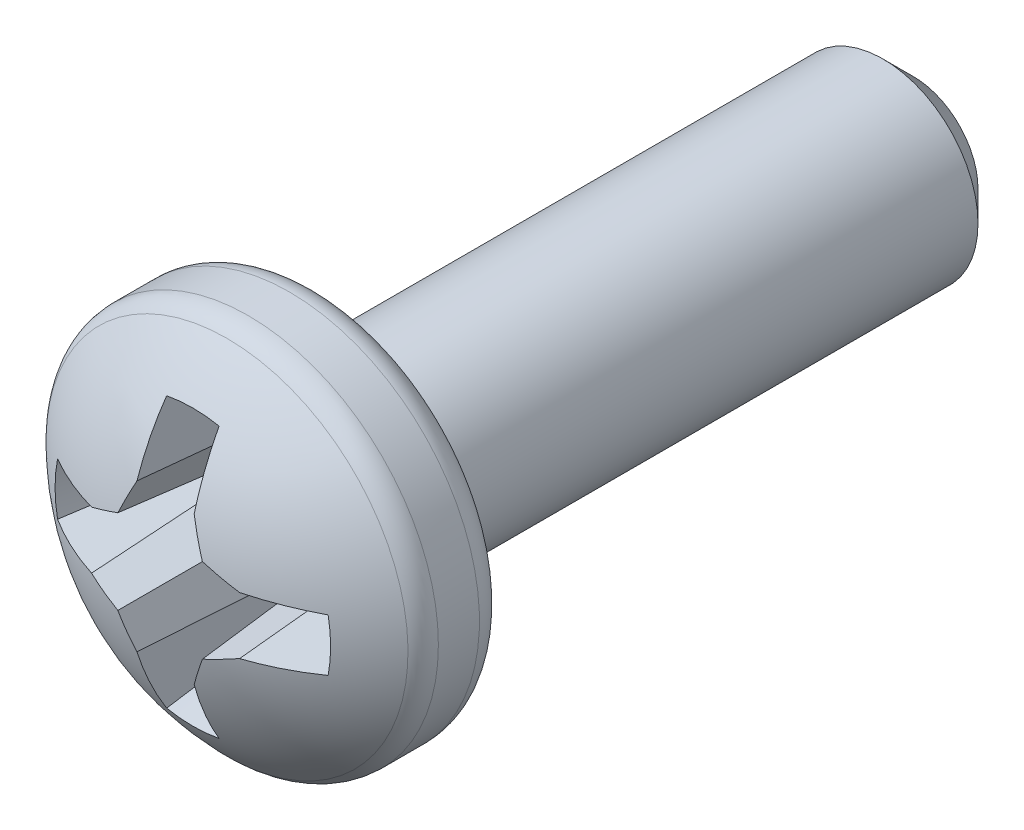
ISO-10303-21;
HEADER;
FILE_DESCRIPTION(('STEP AP214'),'2;1');
FILE_NAME('part.step','',(''),(''),'','','');
FILE_SCHEMA(('AUTOMOTIVE_DESIGN { 1 0 10303 214 1 1 1 1 }'));
ENDSEC;
DATA;
#1=APPLICATION_CONTEXT('core data for automotive mechanical design processes');
#2=APPLICATION_PROTOCOL_DEFINITION('international standard','automotive_design',2000,#1);
#3=PRODUCT_CONTEXT('',#1,'mechanical');
#4=PRODUCT('Part','Part','',(#3));
#5=PRODUCT_RELATED_PRODUCT_CATEGORY('part','',(#4));
#6=PRODUCT_DEFINITION_FORMATION('','',#4);
#7=PRODUCT_DEFINITION_CONTEXT('part definition',#1,'design');
#8=PRODUCT_DEFINITION('design','',#6,#7);
#9=PRODUCT_DEFINITION_SHAPE('','',#8);
#10=(LENGTH_UNIT() NAMED_UNIT(*) SI_UNIT(.MILLI.,.METRE.));
#11=(NAMED_UNIT(*) PLANE_ANGLE_UNIT() SI_UNIT($,.RADIAN.));
#12=(NAMED_UNIT(*) SI_UNIT($,.STERADIAN.) SOLID_ANGLE_UNIT());
#13=UNCERTAINTY_MEASURE_WITH_UNIT(LENGTH_MEASURE(1.E-05),#10,'distance_accuracy_value','');
#14=(GEOMETRIC_REPRESENTATION_CONTEXT(3) GLOBAL_UNCERTAINTY_ASSIGNED_CONTEXT((#13)) GLOBAL_UNIT_ASSIGNED_CONTEXT((#10,
#11,#12)) REPRESENTATION_CONTEXT('',''));
#15=CARTESIAN_POINT('',(0.,0.,0.));
#16=DIRECTION('',(0.,0.,1.));
#17=DIRECTION('',(1.,0.,0.));
#18=AXIS2_PLACEMENT_3D('',#15,#16,#17);
#19=CARTESIAN_POINT('',(0.515078325384203,0.791461441644268,0.413196607862429));
#20=DIRECTION('',(0.,0.,1.));
#21=DIRECTION('',(1.,0.,0.));
#22=AXIS2_PLACEMENT_3D('',#19,#20,#21);
#23=PLANE('',#22);
#24=DIRECTION('',(0.382683432365081,-0.92387953251129,0.));
#25=VECTOR('',#24,1.);
#26=CARTESIAN_POINT('',(0.528392212154071,0.796976234112247,0.413196607862429));
#27=LINE('',#26,#25);
#28=CARTESIAN_POINT('',(0.520821966738698,0.815252423264536,0.413196607862429));
#29=VERTEX_POINT('',#28);
#30=CARTESIAN_POINT('',(0.526107910320162,0.802491026580226,0.413196607862429));
#31=VERTEX_POINT('',#30);
#32=EDGE_CURVE('E292',#29,#31,#27,.T.);
#33=ORIENTED_EDGE('',*,*,#32,.F.);
#34=DIRECTION('',(0.,1.,0.));
#35=VECTOR('',#34,1.);
#36=CARTESIAN_POINT('',(0.520821966738698,0.791461441644268,0.413196607862429));
#37=LINE('',#36,#35);
#38=CARTESIAN_POINT('',(0.520821966738698,0.827667770325845,0.413196607862429));
#39=VERTEX_POINT('',#38);
#40=EDGE_CURVE('E168',#39,#29,#37,.F.);
#41=ORIENTED_EDGE('',*,*,#40,.F.);
#42=CARTESIAN_POINT('',(0.515078325384203,0.791461441644268,0.413196607862429));
#43=DIRECTION('',(0.,0.,1.));
#44=DIRECTION('',(1.,0.,0.));
#45=AXIS2_PLACEMENT_3D('',#42,#43,#44);
#46=CIRCLE('',#45,0.0366590732644382);
#47=CARTESIAN_POINT('',(0.509334684029712,0.827667770325846,0.413196607862429));
#48=VERTEX_POINT('',#47);
#49=EDGE_CURVE('E159',#39,#48,#46,.T.);
#50=ORIENTED_EDGE('',*,*,#49,.T.);
#51=DIRECTION('',(0.,1.,0.));
#52=VECTOR('',#51,1.);
#53=CARTESIAN_POINT('',(0.509334684029713,0.791461441644271,0.413196607862429));
#54=LINE('',#53,#52);
#55=CARTESIAN_POINT('',(0.509334684029712,0.815252423264539,0.413196607862429));
#56=VERTEX_POINT('',#55);
#57=EDGE_CURVE('E166',#56,#48,#54,.T.);
#58=ORIENTED_EDGE('',*,*,#57,.F.);
#59=DIRECTION('',(0.382683432365079,0.923879532511291,0.));
#60=VECTOR('',#59,1.);
#61=CARTESIAN_POINT('',(0.501764438614339,0.79697623411225,0.413196607862429));
#62=LINE('',#61,#60);
#63=CARTESIAN_POINT('',(0.504048740448248,0.802491026580229,0.413196607862429));
#64=VERTEX_POINT('',#63);
#65=EDGE_CURVE('E301',#64,#56,#62,.T.);
#66=ORIENTED_EDGE('',*,*,#65,.F.);
#67=DIRECTION('',(0.923879532511289,0.382683432365086,0.));
#68=VECTOR('',#67,1.);
#69=CARTESIAN_POINT('',(0.509563532916228,0.804775328414139,0.413196607862429));
#70=LINE('',#69,#68);
#71=CARTESIAN_POINT('',(0.491287343763938,0.797205082998765,0.413196607862429));
#72=VERTEX_POINT('',#71);
#73=EDGE_CURVE('E307',#72,#64,#70,.T.);
#74=ORIENTED_EDGE('',*,*,#73,.F.);
#75=DIRECTION('',(1.,0.,0.));
#76=VECTOR('',#75,1.);
#77=CARTESIAN_POINT('',(0.515078325384207,0.797205082998765,0.413196607862429));
#78=LINE('',#77,#76);
#79=CARTESIAN_POINT('',(0.478871996676527,0.797205082997996,0.413196607853642));
#80=VERTEX_POINT('',#79);
#81=EDGE_CURVE('E313',#80,#72,#78,.T.);
#82=ORIENTED_EDGE('',*,*,#81,.F.);
#83=CARTESIAN_POINT('',(0.515078325384206,0.791461441644271,0.413196607862429));
#84=DIRECTION('',(0.,0.,1.));
#85=DIRECTION('',(1.,0.,0.));
#86=AXIS2_PLACEMENT_3D('',#83,#84,#85);
#87=CIRCLE('',#86,0.0366590732924525);
#88=CARTESIAN_POINT('',(0.478871996674264,0.78571780028978,0.413196607862429));
#89=VERTEX_POINT('',#88);
#90=EDGE_CURVE('E410',#80,#89,#87,.T.);
#91=ORIENTED_EDGE('',*,*,#90,.T.);
#92=DIRECTION('',(1.,0.,0.));
#93=VECTOR('',#92,1.);
#94=CARTESIAN_POINT('',(0.515078325384203,0.78571780028978,0.413196607862429));
#95=LINE('',#94,#93);
#96=CARTESIAN_POINT('',(0.491287343763935,0.78571780028978,0.413196607862429));
#97=VERTEX_POINT('',#96);
#98=EDGE_CURVE('E247',#97,#89,#95,.F.);
#99=ORIENTED_EDGE('',*,*,#98,.F.);
#100=DIRECTION('',(-0.923879532511292,0.382683432365076,0.));
#101=VECTOR('',#100,1.);
#102=CARTESIAN_POINT('',(0.509563532916224,0.778147554874406,0.413196607862429));
#103=LINE('',#102,#101);
#104=CARTESIAN_POINT('',(0.504048740448245,0.780431856708316,0.413196607862429));
#105=VERTEX_POINT('',#104);
#106=EDGE_CURVE('E248',#105,#97,#103,.T.);
#107=ORIENTED_EDGE('',*,*,#106,.F.);
#108=DIRECTION('',(-0.38268343236509,0.923879532511287,0.));
#109=VECTOR('',#108,1.);
#110=CARTESIAN_POINT('',(0.501764438614335,0.785946649176296,0.413196607862429));
#111=LINE('',#110,#109);
#112=CARTESIAN_POINT('',(0.50933468402971,0.767670460024005,0.413196607862429));
#113=VERTEX_POINT('',#112);
#114=EDGE_CURVE('E254',#113,#105,#111,.T.);
#115=ORIENTED_EDGE('',*,*,#114,.F.);
#116=DIRECTION('',(0.,1.,0.));
#117=VECTOR('',#116,1.);
#118=CARTESIAN_POINT('',(0.509334684029709,0.791461441644275,0.413196607862429));
#119=LINE('',#118,#117);
#120=CARTESIAN_POINT('',(0.50933468402971,0.755255112980187,0.413196607862429));
#121=VERTEX_POINT('',#120);
#122=EDGE_CURVE('E260',#121,#113,#119,.T.);
#123=ORIENTED_EDGE('',*,*,#122,.F.);
#124=CARTESIAN_POINT('',(0.515078325384204,0.791461441644275,0.413196607862429));
#125=DIRECTION('',(0.,0.,1.));
#126=DIRECTION('',(1.,0.,0.));
#127=AXIS2_PLACEMENT_3D('',#124,#125,#126);
#128=CIRCLE('',#127,0.036659073247165);
#129=CARTESIAN_POINT('',(0.520821966738695,0.755255112980186,0.413196607862429));
#130=VERTEX_POINT('',#129);
#131=EDGE_CURVE('E336',#121,#130,#128,.T.);
#132=ORIENTED_EDGE('',*,*,#131,.T.);
#133=DIRECTION('',(0.,1.,0.));
#134=VECTOR('',#133,1.);
#135=CARTESIAN_POINT('',(0.520821966738694,0.791461441644272,0.413196607862429));
#136=LINE('',#135,#134);
#137=CARTESIAN_POINT('',(0.520821966738695,0.767670460024002,0.413196607862429));
#138=VERTEX_POINT('',#137);
#139=EDGE_CURVE('E266',#138,#130,#136,.F.);
#140=ORIENTED_EDGE('',*,*,#139,.F.);
#141=DIRECTION('',(-0.382683432365075,-0.923879532511293,0.));
#142=VECTOR('',#141,1.);
#143=CARTESIAN_POINT('',(0.528392212154069,0.785946649176293,0.413196607862429));
#144=LINE('',#143,#142);
#145=CARTESIAN_POINT('',(0.526107910320159,0.780431856708313,0.413196607862429));
#146=VERTEX_POINT('',#145);
#147=EDGE_CURVE('E267',#146,#138,#144,.T.);
#148=ORIENTED_EDGE('',*,*,#147,.F.);
#149=DIRECTION('',(-0.923879532511286,-0.382683432365092,0.));
#150=VECTOR('',#149,1.);
#151=CARTESIAN_POINT('',(0.520593117852179,0.778147554874402,0.413196607862429));
#152=LINE('',#151,#150);
#153=CARTESIAN_POINT('',(0.538869307004469,0.785717800289777,0.413196607862429));
#154=VERTEX_POINT('',#153);
#155=EDGE_CURVE('E273',#154,#146,#152,.T.);
#156=ORIENTED_EDGE('',*,*,#155,.F.);
#157=DIRECTION('',(1.,0.,0.));
#158=VECTOR('',#157,1.);
#159=CARTESIAN_POINT('',(0.5150783253842,0.785717800289777,0.413196607862429));
#160=LINE('',#159,#158);
#161=CARTESIAN_POINT('',(0.551284654065781,0.785717800289777,0.413196607862429));
#162=VERTEX_POINT('',#161);
#163=EDGE_CURVE('E279',#162,#154,#160,.F.);
#164=ORIENTED_EDGE('',*,*,#163,.F.);
#165=CARTESIAN_POINT('',(0.515078325384203,0.791461441644268,0.413196607862429));
#166=DIRECTION('',(0.,0.,1.));
#167=DIRECTION('',(1.,0.,0.));
#168=AXIS2_PLACEMENT_3D('',#165,#166,#167);
#169=CIRCLE('',#168,0.0366590732644382);
#170=CARTESIAN_POINT('',(0.55128465406578,0.797205082998762,0.413196607862429));
#171=VERTEX_POINT('',#170);
#172=EDGE_CURVE('E492',#162,#171,#169,.T.);
#173=ORIENTED_EDGE('',*,*,#172,.T.);
#174=DIRECTION('',(1.,0.,0.));
#175=VECTOR('',#174,1.);
#176=CARTESIAN_POINT('',(0.515078325384203,0.797205082998762,0.413196607862429));
#177=LINE('',#176,#175);
#178=CARTESIAN_POINT('',(0.538869307004472,0.797205082998762,0.413196607862429));
#179=VERTEX_POINT('',#178);
#180=EDGE_CURVE('E285',#179,#171,#177,.T.);
#181=ORIENTED_EDGE('',*,*,#180,.F.);
#182=DIRECTION('',(0.92387953251129,-0.382683432365083,0.));
#183=VECTOR('',#182,1.);
#184=CARTESIAN_POINT('',(0.520593117852183,0.804775328414136,0.413196607862429));
#185=LINE('',#184,#183);
#186=EDGE_CURVE('E286',#31,#179,#185,.T.);
#187=ORIENTED_EDGE('',*,*,#186,.F.);
#188=EDGE_LOOP('',(#33,#41,#50,#58,#66,#74,#82,#91,#99,#107,#115,#123,#132,#140,#148,#156,#164,
#173,#181,#187));
#189=FACE_BOUND('',#188,.T.);
#190=ADVANCED_FACE('F17',(#189),#23,.T.);
#191=CARTESIAN_POINT('',(0.515078325384207,0.801303961329311,0.460047001563216));
#192=DIRECTION('',(0.,-0.996194698091744,0.0871557427476727));
#193=DIRECTION('',(0.,-0.0871557427476727,-0.996194698091744));
#194=AXIS2_PLACEMENT_3D('',#191,#192,#193);
#195=PLANE('',#194);
#196=DIRECTION('',(0.0173337504938421,-0.0871426484044557,-0.996045029063884));
#197=VECTOR('',#196,1.);
#198=CARTESIAN_POINT('',(0.490543943259579,0.8009424097128,0.455914447676356));
#199=LINE('',#198,#197);
#200=CARTESIAN_POINT('',(0.490543943259579,0.8009424097128,0.455914447676356));
#201=VERTEX_POINT('',#200);
#202=EDGE_CURVE('E310',#201,#72,#199,.T.);
#203=ORIENTED_EDGE('',*,*,#202,.F.);
#204=CARTESIAN_POINT('',(0.4702306923124,0.80015108887588,0.446869609122098));
#205=CARTESIAN_POINT('',(0.473419051995565,0.800321424804083,0.448816557690383));
#206=CARTESIAN_POINT('',(0.476706002749408,0.800472536171256,0.450543768520713));
#207=CARTESIAN_POINT('',(0.483477086398446,0.800736309783544,0.453558714705461));
#208=CARTESIAN_POINT('',(0.486961219293642,0.800848972028658,0.45484645005988));
#209=CARTESIAN_POINT('',(0.490543943259515,0.800942409712743,0.455914447676344));
#210=B_SPLINE_CURVE_WITH_KNOTS('',3,(#204,#205,#206,#207,#208,#209),.UNSPECIFIED.,.F.,.F.,(4,2,
4),(0.,0.0111485978671285,0.0222971957342569),.UNSPECIFIED.);
#211=CARTESIAN_POINT('',(0.470230692322977,0.800151088874494,0.446869609106245));
#212=VERTEX_POINT('',#211);
#213=EDGE_CURVE('E409',#212,#201,#210,.T.);
#214=ORIENTED_EDGE('',*,*,#213,.F.);
#215=CARTESIAN_POINT('',(0.470230692333555,0.800151088873107,0.446869609090391));
#216=CARTESIAN_POINT('',(0.471667160111317,0.79966000435443,0.441256487356838));
#217=CARTESIAN_POINT('',(0.473105502686871,0.799168961608414,0.435643843086986));
#218=CARTESIAN_POINT('',(0.475985937468524,0.798186959649785,0.424419509338453));
#219=CARTESIAN_POINT('',(0.477428029674714,0.797696000437175,0.418807819859794));
#220=CARTESIAN_POINT('',(0.478871996678788,0.797205082997228,0.413196607844861));
#221=B_SPLINE_CURVE_WITH_KNOTS('',3,(#215,#216,#217,#218,#219,#220),.UNSPECIFIED.,.F.,.F.,(4,2,
4),(0.,0.0174443558891328,0.0348887122017161),.UNSPECIFIED.);
#222=EDGE_CURVE('E318',#212,#80,#221,.T.);
#223=ORIENTED_EDGE('',*,*,#222,.T.);
#224=ORIENTED_EDGE('',*,*,#81,.T.);
#225=EDGE_LOOP('',(#203,#214,#223,#224));
#226=FACE_BOUND('',#225,.T.);
#227=ADVANCED_FACE('F427',(#226),#195,.T.);
#228=CARTESIAN_POINT('',(0.507994960087848,0.808562198209984,0.460047001563216));
#229=DIRECTION('',(0.381227206369649,-0.920363891963225,0.0871557427476661));
#230=DIRECTION('',(0.923879532511289,0.382683432365086,0.));
#231=AXIS2_PLACEMENT_3D('',#228,#229,#230);
#232=PLANE('',#231);
#233=DIRECTION('',(0.0666626913468223,-0.0666626913468416,-0.995546167269401));
#234=VECTOR('',#233,1.);
#235=CARTESIAN_POINT('',(0.501066961696687,0.805472805331791,0.457726739301586));
#236=LINE('',#235,#234);
#237=CARTESIAN_POINT('',(0.501066961696687,0.805472805331791,0.457726739301586));
#238=VERTEX_POINT('',#237);
#239=EDGE_CURVE('E304',#238,#64,#236,.T.);
#240=ORIENTED_EDGE('',*,*,#239,.F.);
#241=CARTESIAN_POINT('',(0.490543943259579,0.8009424097128,0.455914447676356));
#242=CARTESIAN_POINT('',(0.492274312814514,0.801700049456703,0.456346321822599));
#243=CARTESIAN_POINT('',(0.494016415795073,0.802456402296903,0.456713283197823));
#244=CARTESIAN_POINT('',(0.497524088607443,0.8039665341699,0.457317380406233));
#245=CARTESIAN_POINT('',(0.499289658439253,0.804720313202696,0.457554516239419));
#246=CARTESIAN_POINT('',(0.501066961696687,0.805472805331791,0.457726739301586));
#247=B_SPLINE_CURVE_WITH_KNOTS('',3,(#241,#242,#243,#244,#245,#246),.UNSPECIFIED.,.F.,.F.,(4,2,
4),(0.,0.00580300590917721,0.0116060118183544),.UNSPECIFIED.);
#248=EDGE_CURVE('E439',#201,#238,#247,.T.);
#249=ORIENTED_EDGE('',*,*,#248,.F.);
#250=ORIENTED_EDGE('',*,*,#202,.T.);
#251=ORIENTED_EDGE('',*,*,#73,.T.);
#252=EDGE_LOOP('',(#240,#249,#250,#251));
#253=FACE_BOUND('',#252,.T.);
#254=ADVANCED_FACE('F431',(#253),#232,.T.);
#255=CARTESIAN_POINT('',(0.497977568818494,0.79854480694063,0.460047001563216));
#256=DIRECTION('',(0.920363891963229,-0.381227206369643,0.0871557427476506));
#257=DIRECTION('',(0.382683432365079,0.923879532511291,0.));
#258=AXIS2_PLACEMENT_3D('',#255,#256,#257);
#259=PLANE('',#258);
#260=DIRECTION('',(0.0871426484044276,-0.0173337504938855,-0.996045029063886));
#261=VECTOR('',#260,1.);
#262=CARTESIAN_POINT('',(0.505597357315678,0.8159958237689,0.455914447676355));
#263=LINE('',#262,#261);
#264=CARTESIAN_POINT('',(0.505597357315678,0.8159958237689,0.455914447676355));
#265=VERTEX_POINT('',#264);
#266=EDGE_CURVE('E176',#265,#56,#263,.T.);
#267=ORIENTED_EDGE('',*,*,#266,.F.);
#268=CARTESIAN_POINT('',(0.501066961696687,0.805472805331791,0.457726739301586));
#269=CARTESIAN_POINT('',(0.501819453825782,0.807250108589226,0.457554516239419));
#270=CARTESIAN_POINT('',(0.502573232858578,0.809015678421036,0.457317380406232));
#271=CARTESIAN_POINT('',(0.504083364731575,0.812523351233405,0.456713283197822));
#272=CARTESIAN_POINT('',(0.504839717571775,0.814265454213965,0.456346321822598));
#273=CARTESIAN_POINT('',(0.505597357315678,0.8159958237689,0.455914447676355));
#274=B_SPLINE_CURVE_WITH_KNOTS('',3,(#268,#269,#270,#271,#272,#273),.UNSPECIFIED.,.F.,.F.,(4,2,
4),(0.,0.00580300590917794,0.0116060118183557),.UNSPECIFIED.);
#275=EDGE_CURVE('E445',#238,#265,#274,.T.);
#276=ORIENTED_EDGE('',*,*,#275,.F.);
#277=ORIENTED_EDGE('',*,*,#239,.T.);
#278=ORIENTED_EDGE('',*,*,#65,.T.);
#279=EDGE_LOOP('',(#267,#276,#277,#278));
#280=FACE_BOUND('',#279,.T.);
#281=ADVANCED_FACE('F436',(#280),#259,.T.);
#282=CARTESIAN_POINT('',(0.505235805699168,0.791461441644271,0.460047001563216));
#283=DIRECTION('',(0.996194698091747,0.,0.0871557427476441));
#284=DIRECTION('',(0.0871557427476441,0.,-0.996194698091747));
#285=AXIS2_PLACEMENT_3D('',#282,#283,#284);
#286=PLANE('',#285);
#287=CARTESIAN_POINT('',(0.509334684031052,0.827667770321906,0.413196607847123));
#288=CARTESIAN_POINT('',(0.508843766591138,0.829111737330646,0.418807819861677));
#289=CARTESIAN_POINT('',(0.508352807378561,0.830553829541518,0.424419509339952));
#290=CARTESIAN_POINT('',(0.50737080542,0.833434264332566,0.435643843087716));
#291=CARTESIAN_POINT('',(0.506879762674018,0.834872606912833,0.44125648735718));
#292=CARTESIAN_POINT('',(0.506388678155376,0.836309074695323,0.446869609090344));
#293=B_SPLINE_CURVE_WITH_KNOTS('',3,(#287,#288,#289,#290,#291,#292),.UNSPECIFIED.,.F.,.F.,(4,2,
4),(0.,0.01744435631495,0.0348887122064498),.UNSPECIFIED.);
#294=CARTESIAN_POINT('',(0.506388678157148,0.836309074690137,0.446869609070085));
#295=VERTEX_POINT('',#294);
#296=EDGE_CURVE('E170',#48,#295,#293,.T.);
#297=ORIENTED_EDGE('',*,*,#296,.T.);
#298=CARTESIAN_POINT('',(0.505597357315678,0.8159958237689,0.455914447676355));
#299=CARTESIAN_POINT('',(0.505690794999793,0.819578547734809,0.454846450059887));
#300=CARTESIAN_POINT('',(0.505803457244927,0.823062680630038,0.453558714705458));
#301=CARTESIAN_POINT('',(0.506067230857234,0.829833764279139,0.450543768520679));
#302=CARTESIAN_POINT('',(0.506218342224407,0.833120715033011,0.448816557690328));
#303=CARTESIAN_POINT('',(0.5063886781526,0.836309074716203,0.446869609122017));
#304=B_SPLINE_CURVE_WITH_KNOTS('',3,(#298,#299,#300,#301,#302,#303),.UNSPECIFIED.,.F.,.F.,(4,2,
4),(0.,0.0111485978672344,0.022297195734469),.UNSPECIFIED.);
#305=EDGE_CURVE('E450',#265,#295,#304,.T.);
#306=ORIENTED_EDGE('',*,*,#305,.F.);
#307=ORIENTED_EDGE('',*,*,#266,.T.);
#308=ORIENTED_EDGE('',*,*,#57,.T.);
#309=EDGE_LOOP('',(#297,#306,#307,#308));
#310=FACE_BOUND('',#309,.T.);
#311=ADVANCED_FACE('F173',(#310),#286,.T.);
#312=CARTESIAN_POINT('',(0.515078325384203,0.791461441644268,0.446869608879297));
#313=DIRECTION('',(0.,0.,1.));
#314=DIRECTION('',(1.,0.,0.));
#315=AXIS2_PLACEMENT_3D('',#312,#313,#314);
#316=CONICAL_SURFACE('',#315,0.0456817266976294,0.261799387909679);
#317=ORIENTED_EDGE('',*,*,#296,.F.);
#318=ORIENTED_EDGE('',*,*,#49,.F.);
#319=CARTESIAN_POINT('',(0.523767972615257,0.836309074701822,0.446869609115738));
#320=CARTESIAN_POINT('',(0.523276888096404,0.834872606918724,0.44125648738018));
#321=CARTESIAN_POINT('',(0.522785845350213,0.833434264337848,0.43564384310832));
#322=CARTESIAN_POINT('',(0.521803843391233,0.830553829545579,0.424419509355768));
#323=CARTESIAN_POINT('',(0.521312884178447,0.829111737334096,0.418807819875098));
#324=CARTESIAN_POINT('',(0.520821966738323,0.827667770324744,0.413196607858151));
#325=B_SPLINE_CURVE_WITH_KNOTS('',3,(#319,#320,#321,#322,#323,#324),.UNSPECIFIED.,.F.,.F.,(4,2,
4),(0.,0.0174443558989396,0.0348887122213296),.UNSPECIFIED.);
#326=CARTESIAN_POINT('',(0.523767972615744,0.836309074705034,0.44686960912131));
#327=VERTEX_POINT('',#326);
#328=EDGE_CURVE('E182',#327,#39,#325,.T.);
#329=ORIENTED_EDGE('',*,*,#328,.F.);
#330=CARTESIAN_POINT('',(0.515078325384203,0.791461441644268,0.446869609049827));
#331=DIRECTION('',(0.,0.,1.));
#332=DIRECTION('',(1.,0.,0.));
#333=AXIS2_PLACEMENT_3D('',#330,#331,#332);
#334=CIRCLE('',#333,0.0456817267433228);
#335=EDGE_CURVE('E180',#295,#327,#334,.F.);
#336=ORIENTED_EDGE('',*,*,#335,.F.);
#337=EDGE_LOOP('',(#317,#318,#329,#336));
#338=FACE_BOUND('',#337,.T.);
#339=ADVANCED_FACE('F178',(#338),#316,.F.);
#340=CARTESIAN_POINT('',(0.524920845069243,0.791461441644268,0.460047001563216));
#341=DIRECTION('',(-0.996194698091746,0.,0.0871557427476584));
#342=DIRECTION('',(0.0871557427476584,0.,0.996194698091746));
#343=AXIS2_PLACEMENT_3D('',#340,#341,#342);
#344=PLANE('',#343);
#345=DIRECTION('',(-0.0871426484044405,-0.0173337504938649,-0.996045029063885));
#346=VECTOR('',#345,1.);
#347=CARTESIAN_POINT('',(0.524559293452732,0.815995823768896,0.455914447676356));
#348=LINE('',#347,#346);
#349=CARTESIAN_POINT('',(0.524559293452732,0.815995823768896,0.455914447676356));
#350=VERTEX_POINT('',#349);
#351=EDGE_CURVE('E295',#350,#29,#348,.T.);
#352=ORIENTED_EDGE('',*,*,#351,.F.);
#353=CARTESIAN_POINT('',(0.523767972616232,0.836309074708246,0.446869609126883));
#354=CARTESIAN_POINT('',(0.523938308544324,0.833120715026192,0.448816557694025));
#355=CARTESIAN_POINT('',(0.524089419911412,0.829833764273554,0.450543768523385));
#356=CARTESIAN_POINT('',(0.524353193523581,0.823062680627109,0.453558714706541));
#357=CARTESIAN_POINT('',(0.524465855768661,0.819578547733302,0.454846450060337));
#358=CARTESIAN_POINT('',(0.524559293452738,0.81599582376891,0.45591444767635));
#359=B_SPLINE_CURVE_WITH_KNOTS('',3,(#353,#354,#355,#356,#357,#358),.UNSPECIFIED.,.F.,.F.,(4,2,
4),(0.,0.0111485978625707,0.0222971957251414),.UNSPECIFIED.);
#360=EDGE_CURVE('E210',#327,#350,#359,.T.);
#361=ORIENTED_EDGE('',*,*,#360,.F.);
#362=ORIENTED_EDGE('',*,*,#328,.T.);
#363=ORIENTED_EDGE('',*,*,#40,.T.);
#364=EDGE_LOOP('',(#352,#361,#362,#363));
#365=FACE_BOUND('',#364,.T.);
#366=ADVANCED_FACE('F199',(#365),#344,.T.);
#367=CARTESIAN_POINT('',(0.532179081949916,0.798544806940627,0.460047001563216));
#368=DIRECTION('',(-0.920363891963228,-0.381227206369645,0.0871557427476584));
#369=DIRECTION('',(0.382683432365081,-0.92387953251129,0.));
#370=AXIS2_PLACEMENT_3D('',#367,#368,#369);
#371=PLANE('',#370);
#372=DIRECTION('',(-0.066662691346815,-0.0666626913468393,-0.995546167269402));
#373=VECTOR('',#372,1.);
#374=CARTESIAN_POINT('',(0.529089689071723,0.805472805331788,0.457726739301586));
#375=LINE('',#374,#373);
#376=CARTESIAN_POINT('',(0.529089689071723,0.805472805331788,0.457726739301586));
#377=VERTEX_POINT('',#376);
#378=EDGE_CURVE('E289',#377,#31,#375,.T.);
#379=ORIENTED_EDGE('',*,*,#378,.F.);
#380=CARTESIAN_POINT('',(0.524559293452732,0.815995823768896,0.455914447676356));
#381=CARTESIAN_POINT('',(0.525316933196635,0.814265454213961,0.456346321822598));
#382=CARTESIAN_POINT('',(0.526073286036835,0.812523351233401,0.456713283197823));
#383=CARTESIAN_POINT('',(0.527583417909832,0.809015678421032,0.457317380406233));
#384=CARTESIAN_POINT('',(0.528337196942628,0.807250108589223,0.457554516239419));
#385=CARTESIAN_POINT('',(0.529089689071723,0.805472805331788,0.457726739301586));
#386=B_SPLINE_CURVE_WITH_KNOTS('',3,(#380,#381,#382,#383,#384,#385),.UNSPECIFIED.,.F.,.F.,(4,2,
4),(0.,0.00580300590917684,0.0116060118183539),.UNSPECIFIED.);
#387=EDGE_CURVE('E218',#350,#377,#386,.T.);
#388=ORIENTED_EDGE('',*,*,#387,.F.);
#389=ORIENTED_EDGE('',*,*,#351,.T.);
#390=ORIENTED_EDGE('',*,*,#32,.T.);
#391=EDGE_LOOP('',(#379,#388,#389,#390));
#392=FACE_BOUND('',#391,.T.);
#393=ADVANCED_FACE('F204',(#392),#371,.T.);
#394=CARTESIAN_POINT('',(0.522161690680563,0.808562198209981,0.460047001563216));
#395=DIRECTION('',(-0.381227206369647,-0.920363891963227,0.0871557427476583));
#396=DIRECTION('',(0.92387953251129,-0.382683432365083,0.));
#397=AXIS2_PLACEMENT_3D('',#394,#395,#396);
#398=PLANE('',#397);
#399=DIRECTION('',(-0.0173337504938598,-0.0871426484044405,-0.996045029063885));
#400=VECTOR('',#399,1.);
#401=CARTESIAN_POINT('',(0.539612707508832,0.800942409712797,0.455914447676356));
#402=LINE('',#401,#400);
#403=CARTESIAN_POINT('',(0.539612707508832,0.800942409712797,0.455914447676356));
#404=VERTEX_POINT('',#403);
#405=EDGE_CURVE('E282',#404,#179,#402,.T.);
#406=ORIENTED_EDGE('',*,*,#405,.F.);
#407=CARTESIAN_POINT('',(0.529089689071723,0.805472805331788,0.457726739301586));
#408=CARTESIAN_POINT('',(0.530866992329158,0.804720313202694,0.457554516239419));
#409=CARTESIAN_POINT('',(0.532632562160968,0.803966534169897,0.457317380406232));
#410=CARTESIAN_POINT('',(0.536140234973337,0.8024564022969,0.456713283197822));
#411=CARTESIAN_POINT('',(0.537882337953897,0.8017000494567,0.456346321822598));
#412=CARTESIAN_POINT('',(0.539612707508832,0.800942409712797,0.455914447676355));
#413=B_SPLINE_CURVE_WITH_KNOTS('',3,(#407,#408,#409,#410,#411,#412),.UNSPECIFIED.,.F.,.F.,(4,2,
4),(0.,0.00580300590917777,0.0116060118183553),.UNSPECIFIED.);
#414=EDGE_CURVE('E462',#377,#404,#413,.T.);
#415=ORIENTED_EDGE('',*,*,#414,.F.);
#416=ORIENTED_EDGE('',*,*,#378,.T.);
#417=ORIENTED_EDGE('',*,*,#186,.T.);
#418=EDGE_LOOP('',(#406,#415,#416,#417));
#419=FACE_BOUND('',#418,.T.);
#420=ADVANCED_FACE('F474',(#419),#398,.T.);
#421=CARTESIAN_POINT('',(0.515078325384203,0.801303961329307,0.460047001563216));
#422=DIRECTION('',(0.,-0.996194698091746,0.0871557427476584));
#423=DIRECTION('',(0.,-0.0871557427476584,-0.996194698091746));
#424=AXIS2_PLACEMENT_3D('',#421,#422,#423);
#425=PLANE('',#424);
#426=CARTESIAN_POINT('',(0.551284654061709,0.797205082997378,0.413196607846613));
#427=CARTESIAN_POINT('',(0.552728621070471,0.797696000437299,0.418807819861252));
#428=CARTESIAN_POINT('',(0.554170713281365,0.798186959649884,0.424419509339612));
#429=CARTESIAN_POINT('',(0.557051148072456,0.799168961608459,0.435643843087546));
#430=CARTESIAN_POINT('',(0.558489490652745,0.799660004354449,0.441256487357095));
#431=CARTESIAN_POINT('',(0.559925958435257,0.800151088873099,0.446869609090344));
#432=B_SPLINE_CURVE_WITH_KNOTS('',3,(#426,#427,#428,#429,#430,#431),.UNSPECIFIED.,.F.,.F.,(4,2,
4),(0.,0.0174443563152142,0.0348887122069779),.UNSPECIFIED.);
#433=CARTESIAN_POINT('',(0.559925958430071,0.800151088871326,0.446869609070085));
#434=VERTEX_POINT('',#433);
#435=EDGE_CURVE('E351',#171,#434,#432,.T.);
#436=ORIENTED_EDGE('',*,*,#435,.T.);
#437=CARTESIAN_POINT('',(0.539612707508832,0.800942409712797,0.455914447676355));
#438=CARTESIAN_POINT('',(0.543195431474753,0.800848972028701,0.454846450059881));
#439=CARTESIAN_POINT('',(0.546679564369995,0.800736309783567,0.453558714705447));
#440=CARTESIAN_POINT('',(0.553450648019119,0.80047253617122,0.450543768520659));
#441=CARTESIAN_POINT('',(0.556737598773001,0.800321424804007,0.448816557690305));
#442=CARTESIAN_POINT('',(0.559925958456204,0.800151088875756,0.44686960912199));
#443=B_SPLINE_CURVE_WITH_KNOTS('',3,(#437,#438,#439,#440,#441,#442),.UNSPECIFIED.,.F.,.F.,(4,2,
4),(0.,0.0111485978672741,0.0222971957345481),.UNSPECIFIED.);
#444=EDGE_CURVE('E463',#404,#434,#443,.T.);
#445=ORIENTED_EDGE('',*,*,#444,.F.);
#446=ORIENTED_EDGE('',*,*,#405,.T.);
#447=ORIENTED_EDGE('',*,*,#180,.T.);
#448=EDGE_LOOP('',(#436,#445,#446,#447));
#449=FACE_BOUND('',#448,.T.);
#450=ADVANCED_FACE('F477',(#449),#425,.T.);
#451=CARTESIAN_POINT('',(0.515078325384203,0.791461441644268,0.446869608879297));
#452=DIRECTION('',(0.,0.,1.));
#453=DIRECTION('',(1.,0.,0.));
#454=AXIS2_PLACEMENT_3D('',#451,#452,#453);
#455=CONICAL_SURFACE('',#454,0.0456817266976294,0.261799387909679);
#456=ORIENTED_EDGE('',*,*,#172,.F.);
#457=CARTESIAN_POINT('',(0.559925958441758,0.782771794413219,0.446869609115738));
#458=CARTESIAN_POINT('',(0.558489490658638,0.783262878932079,0.441256487380095));
#459=CARTESIAN_POINT('',(0.55705114807774,0.783753921678277,0.43564384310815));
#460=CARTESIAN_POINT('',(0.554170713285427,0.784735923637272,0.424419509355428));
#461=CARTESIAN_POINT('',(0.552728621073922,0.785226882850065,0.418807819874673));
#462=CARTESIAN_POINT('',(0.551284654064548,0.785717800290196,0.413196607857641));
#463=B_SPLINE_CURVE_WITH_KNOTS('',3,(#457,#458,#459,#460,#461,#462),.UNSPECIFIED.,.F.,.F.,(4,2,
4),(0.,0.0174443558992038,0.0348887122218578),.UNSPECIFIED.);
#464=CARTESIAN_POINT('',(0.55992595844497,0.782771794412731,0.44686960912131));
#465=VERTEX_POINT('',#464);
#466=EDGE_CURVE('E346',#465,#162,#463,.T.);
#467=ORIENTED_EDGE('',*,*,#466,.F.);
#468=CARTESIAN_POINT('',(0.515078325384203,0.791461441644268,0.446869609049827));
#469=DIRECTION('',(0.,0.,1.));
#470=DIRECTION('',(1.,0.,0.));
#471=AXIS2_PLACEMENT_3D('',#468,#469,#470);
#472=CIRCLE('',#471,0.0456817267433228);
#473=EDGE_CURVE('E464',#434,#465,#472,.F.);
#474=ORIENTED_EDGE('',*,*,#473,.F.);
#475=ORIENTED_EDGE('',*,*,#435,.F.);
#476=EDGE_LOOP('',(#456,#467,#474,#475));
#477=FACE_BOUND('',#476,.T.);
#478=ADVANCED_FACE('F482',(#477),#455,.F.);
#479=CARTESIAN_POINT('',(0.5150783253842,0.781618921959232,0.460047001563216));
#480=DIRECTION('',(0.,0.996194698091747,0.0871557427476441));
#481=DIRECTION('',(0.,-0.0871557427476441,0.996194698091747));
#482=AXIS2_PLACEMENT_3D('',#479,#480,#481);
#483=PLANE('',#482);
#484=DIRECTION('',(-0.0173337504938417,0.0871426484044261,-0.996045029063887));
#485=VECTOR('',#484,1.);
#486=CARTESIAN_POINT('',(0.539612707508828,0.781980473575742,0.455914447676357));
#487=LINE('',#486,#485);
#488=CARTESIAN_POINT('',(0.539612707508828,0.781980473575742,0.455914447676357));
#489=VERTEX_POINT('',#488);
#490=EDGE_CURVE('E276',#489,#154,#487,.T.);
#491=ORIENTED_EDGE('',*,*,#490,.F.);
#492=CARTESIAN_POINT('',(0.559925958448182,0.782771794412244,0.446869609126882));
#493=CARTESIAN_POINT('',(0.556737598766135,0.782601458484142,0.44881655769402));
#494=CARTESIAN_POINT('',(0.553450648013504,0.782450347117054,0.450543768523377));
#495=CARTESIAN_POINT('',(0.546679564367074,0.782186573504906,0.453558714706531));
#496=CARTESIAN_POINT('',(0.543195431473275,0.782073911259846,0.454846450060328));
#497=CARTESIAN_POINT('',(0.539612707508892,0.7819804735758,0.455914447676344));
#498=B_SPLINE_CURVE_WITH_KNOTS('',3,(#492,#493,#494,#495,#496,#497),.UNSPECIFIED.,.F.,.F.,(4,2,
4),(0.,0.0111485978625475,0.0222971957250951),.UNSPECIFIED.);
#499=EDGE_CURVE('E509',#465,#489,#498,.T.);
#500=ORIENTED_EDGE('',*,*,#499,.F.);
#501=ORIENTED_EDGE('',*,*,#466,.T.);
#502=ORIENTED_EDGE('',*,*,#163,.T.);
#503=EDGE_LOOP('',(#491,#500,#501,#502));
#504=FACE_BOUND('',#503,.T.);
#505=ADVANCED_FACE('F499',(#504),#483,.T.);
#506=CARTESIAN_POINT('',(0.522161690680559,0.774360685078558,0.460047001563216));
#507=DIRECTION('',(-0.381227206369656,0.920363891963225,0.0871557427476397));
#508=DIRECTION('',(-0.923879532511286,-0.382683432365092,0.));
#509=AXIS2_PLACEMENT_3D('',#506,#507,#508);
#510=PLANE('',#509);
#511=DIRECTION('',(-0.066662691346817,0.0666626913468194,-0.995546167269403));
#512=VECTOR('',#511,1.);
#513=CARTESIAN_POINT('',(0.52908968907172,0.777450077956752,0.457726739301588));
#514=LINE('',#513,#512);
#515=CARTESIAN_POINT('',(0.52908968907172,0.777450077956752,0.457726739301588));
#516=VERTEX_POINT('',#515);
#517=EDGE_CURVE('E270',#516,#146,#514,.T.);
#518=ORIENTED_EDGE('',*,*,#517,.F.);
#519=CARTESIAN_POINT('',(0.539612707508828,0.781980473575742,0.455914447676357));
#520=CARTESIAN_POINT('',(0.537882337953894,0.78122283383184,0.4563463218226));
#521=CARTESIAN_POINT('',(0.536140234973334,0.780466480991639,0.456713283197824));
#522=CARTESIAN_POINT('',(0.532632562160965,0.778956349118642,0.457317380406234));
#523=CARTESIAN_POINT('',(0.530866992329155,0.778202570085846,0.45755451623942));
#524=CARTESIAN_POINT('',(0.52908968907172,0.777450077956751,0.457726739301587));
#525=B_SPLINE_CURVE_WITH_KNOTS('',3,(#519,#520,#521,#522,#523,#524),.UNSPECIFIED.,.F.,.F.,(4,2,
4),(0.,0.00580300590917706,0.0116060118183544),.UNSPECIFIED.);
#526=EDGE_CURVE('E515',#489,#516,#525,.T.);
#527=ORIENTED_EDGE('',*,*,#526,.F.);
#528=ORIENTED_EDGE('',*,*,#490,.T.);
#529=ORIENTED_EDGE('',*,*,#155,.T.);
#530=EDGE_LOOP('',(#518,#527,#528,#529));
#531=FACE_BOUND('',#530,.T.);
#532=ADVANCED_FACE('F503',(#531),#510,.T.);
#533=CARTESIAN_POINT('',(0.532179081949913,0.784378076347913,0.460047001563216));
#534=DIRECTION('',(-0.920363891963232,0.381227206369639,0.0871557427476397));
#535=DIRECTION('',(-0.382683432365075,-0.923879532511293,0.));
#536=AXIS2_PLACEMENT_3D('',#533,#534,#535);
#537=PLANE('',#536);
#538=DIRECTION('',(-0.087142648404426,0.0173337504938367,-0.996045029063887));
#539=VECTOR('',#538,1.);
#540=CARTESIAN_POINT('',(0.524559293452729,0.766927059519643,0.455914447676357));
#541=LINE('',#540,#539);
#542=CARTESIAN_POINT('',(0.524559293452729,0.766927059519643,0.455914447676357));
#543=VERTEX_POINT('',#542);
#544=EDGE_CURVE('E263',#543,#138,#541,.T.);
#545=ORIENTED_EDGE('',*,*,#544,.F.);
#546=CARTESIAN_POINT('',(0.52908968907172,0.777450077956752,0.457726739301587));
#547=CARTESIAN_POINT('',(0.528337196942626,0.775672774699317,0.45755451623942));
#548=CARTESIAN_POINT('',(0.527583417909829,0.773907204867507,0.457317380406234));
#549=CARTESIAN_POINT('',(0.526073286036832,0.770399532055138,0.456713283197824));
#550=CARTESIAN_POINT('',(0.525316933196632,0.768657429074578,0.4563463218226));
#551=CARTESIAN_POINT('',(0.524559293452729,0.766927059519643,0.455914447676357));
#552=B_SPLINE_CURVE_WITH_KNOTS('',3,(#546,#547,#548,#549,#550,#551),.UNSPECIFIED.,.F.,.F.,(4,2,
4),(0.,0.00580300590917774,0.0116060118183553),.UNSPECIFIED.);
#553=EDGE_CURVE('E535',#516,#543,#552,.T.);
#554=ORIENTED_EDGE('',*,*,#553,.F.);
#555=ORIENTED_EDGE('',*,*,#517,.T.);
#556=ORIENTED_EDGE('',*,*,#147,.T.);
#557=EDGE_LOOP('',(#545,#554,#555,#556));
#558=FACE_BOUND('',#557,.T.);
#559=ADVANCED_FACE('F548',(#558),#537,.T.);
#560=CARTESIAN_POINT('',(0.524920845069239,0.791461441644272,0.460047001563216));
#561=DIRECTION('',(-0.996194698091747,0.,0.0871557427476441));
#562=DIRECTION('',(0.0871557427476441,0.,0.996194698091747));
#563=AXIS2_PLACEMENT_3D('',#560,#561,#562);
#564=PLANE('',#563);
#565=CARTESIAN_POINT('',(0.520821966740492,0.755255112974898,0.413196607882972));
#566=CARTESIAN_POINT('',(0.521312884180279,0.753811145963647,0.418807819896074));
#567=CARTESIAN_POINT('',(0.521803843392728,0.752369053750253,0.424419509372897));
#568=CARTESIAN_POINT('',(0.522785845351035,0.749488618954138,0.43564384311775));
#569=CARTESIAN_POINT('',(0.523276888096889,0.748050276371326,0.441256487385758));
#570=CARTESIAN_POINT('',(0.523767972615404,0.74661380858628,0.446869609117462));
#571=B_SPLINE_CURVE_WITH_KNOTS('',3,(#565,#566,#567,#568,#569,#570),.UNSPECIFIED.,.F.,.F.,(4,2,
4),(0.,0.0174443563125874,0.0348887122017245),.UNSPECIFIED.);
#572=CARTESIAN_POINT('',(0.523767972614932,0.746613808587661,0.446869609112066));
#573=VERTEX_POINT('',#572);
#574=EDGE_CURVE('E559',#130,#573,#571,.T.);
#575=ORIENTED_EDGE('',*,*,#574,.T.);
#576=CARTESIAN_POINT('',(0.524559293452729,0.766927059519643,0.455914447676357));
#577=CARTESIAN_POINT('',(0.524465855768659,0.763344335555424,0.454846450060396));
#578=CARTESIAN_POINT('',(0.524353193523587,0.759860202661779,0.453558714706672));
#579=CARTESIAN_POINT('',(0.524089419911438,0.753089119015636,0.450543768523703));
#580=CARTESIAN_POINT('',(0.523938308544361,0.749802168263138,0.448816557694456));
#581=CARTESIAN_POINT('',(0.523767972616282,0.746613808581213,0.446869609127447));
#582=B_SPLINE_CURVE_WITH_KNOTS('',3,(#576,#577,#578,#579,#580,#581),.UNSPECIFIED.,.F.,.F.,(4,2,
4),(0.,0.0111485978620393,0.0222971957240786),.UNSPECIFIED.);
#583=EDGE_CURVE('E536',#543,#573,#582,.T.);
#584=ORIENTED_EDGE('',*,*,#583,.F.);
#585=ORIENTED_EDGE('',*,*,#544,.T.);
#586=ORIENTED_EDGE('',*,*,#139,.T.);
#587=EDGE_LOOP('',(#575,#584,#585,#586));
#588=FACE_BOUND('',#587,.T.);
#589=ADVANCED_FACE('F551',(#588),#564,.T.);
#590=CARTESIAN_POINT('',(0.515078325384204,0.791461441644275,0.446869608879296));
#591=DIRECTION('',(0.,0.,1.));
#592=DIRECTION('',(0.,-1.,0.));
#593=AXIS2_PLACEMENT_3D('',#590,#591,#592);
#594=CONICAL_SURFACE('',#593,0.0456817266976282,0.261799388388258);
#595=ORIENTED_EDGE('',*,*,#131,.F.);
#596=CARTESIAN_POINT('',(0.506388678152323,0.746613808584299,0.446869609125202));
#597=CARTESIAN_POINT('',(0.506879762671099,0.748050276370107,0.441256487390514));
#598=CARTESIAN_POINT('',(0.507370805417214,0.749488618953682,0.435643843119524));
#599=CARTESIAN_POINT('',(0.508352807376042,0.752369053751329,0.424419509368708));
#600=CARTESIAN_POINT('',(0.508843766588753,0.753811145965491,0.418807819888904));
#601=CARTESIAN_POINT('',(0.5093346840288,0.755255112977511,0.413196607872821));
#602=B_SPLINE_CURVE_WITH_KNOTS('',3,(#596,#597,#598,#599,#600,#601),.UNSPECIFIED.,.F.,.F.,(4,2,
4),(0.,0.0174443558984055,0.0348887122202614),.UNSPECIFIED.);
#603=CARTESIAN_POINT('',(0.506388678152185,0.746613808583504,0.446869609126781));
#604=VERTEX_POINT('',#603);
#605=EDGE_CURVE('E331',#604,#121,#602,.T.);
#606=ORIENTED_EDGE('',*,*,#605,.F.);
#607=CARTESIAN_POINT('',(0.515078325384204,0.791461441644275,0.44686960910667));
#608=DIRECTION('',(0.,0.,1.));
#609=DIRECTION('',(0.,-1.,0.));
#610=AXIS2_PLACEMENT_3D('',#607,#608,#609);
#611=CIRCLE('',#610,0.0456817267585528);
#612=EDGE_CURVE('E538',#573,#604,#611,.F.);
#613=ORIENTED_EDGE('',*,*,#612,.F.);
#614=ORIENTED_EDGE('',*,*,#574,.F.);
#615=EDGE_LOOP('',(#595,#606,#613,#614));
#616=FACE_BOUND('',#615,.T.);
#617=ADVANCED_FACE('F555',(#616),#594,.F.);
#618=CARTESIAN_POINT('',(0.505235805699164,0.791461441644275,0.460047001563216));
#619=DIRECTION('',(0.996194698091746,0.,0.0871557427476584));
#620=DIRECTION('',(0.0871557427476584,0.,-0.996194698091746));
#621=AXIS2_PLACEMENT_3D('',#618,#619,#620);
#622=PLANE('',#621);
#623=DIRECTION('',(0.0871426484044413,0.0173337504938286,-0.996045029063886));
#624=VECTOR('',#623,1.);
#625=CARTESIAN_POINT('',(0.505597357315675,0.766927059519646,0.455914447676358));
#626=LINE('',#625,#624);
#627=CARTESIAN_POINT('',(0.505597357315675,0.766927059519647,0.455914447676358));
#628=VERTEX_POINT('',#627);
#629=EDGE_CURVE('E257',#628,#113,#626,.T.);
#630=ORIENTED_EDGE('',*,*,#629,.F.);
#631=CARTESIAN_POINT('',(0.506388678152047,0.746613808582708,0.446869609128361));
#632=CARTESIAN_POINT('',(0.506218342223985,0.749802168264417,0.448816557695149));
#633=CARTESIAN_POINT('',(0.506067230856923,0.753089119016682,0.450543768524209));
#634=CARTESIAN_POINT('',(0.505803457244798,0.759860202662323,0.453558714706873));
#635=CARTESIAN_POINT('',(0.505690794999734,0.763344335555699,0.454846450060477));
#636=CARTESIAN_POINT('',(0.505597357315669,0.766927059519632,0.455914447676352));
#637=B_SPLINE_CURVE_WITH_KNOTS('',3,(#631,#632,#633,#634,#635,#636),.UNSPECIFIED.,.F.,.F.,(4,2,
4),(0.,0.0111485978611586,0.0222971957223172),.UNSPECIFIED.);
#638=EDGE_CURVE('E574',#604,#628,#637,.T.);
#639=ORIENTED_EDGE('',*,*,#638,.F.);
#640=ORIENTED_EDGE('',*,*,#605,.T.);
#641=ORIENTED_EDGE('',*,*,#122,.T.);
#642=EDGE_LOOP('',(#630,#639,#640,#641));
#643=FACE_BOUND('',#642,.T.);
#644=ADVANCED_FACE('F582',(#643),#622,.T.);
#645=CARTESIAN_POINT('',(0.497977568818491,0.784378076347916,0.460047001563216));
#646=DIRECTION('',(0.920363891963225,0.381227206369654,0.0871557427476474));
#647=DIRECTION('',(-0.38268343236509,0.923879532511287,0.));
#648=AXIS2_PLACEMENT_3D('',#645,#646,#647);
#649=PLANE('',#648);
#650=DIRECTION('',(0.0666626913468243,0.0666626913468074,-0.995546167269403));
#651=VECTOR('',#650,1.);
#652=CARTESIAN_POINT('',(0.501066961696684,0.777450077956755,0.457726739301588));
#653=LINE('',#652,#651);
#654=CARTESIAN_POINT('',(0.501066961696684,0.777450077956755,0.457726739301588));
#655=VERTEX_POINT('',#654);
#656=EDGE_CURVE('E251',#655,#105,#653,.T.);
#657=ORIENTED_EDGE('',*,*,#656,.F.);
#658=CARTESIAN_POINT('',(0.505597357315675,0.766927059519647,0.455914447676357));
#659=CARTESIAN_POINT('',(0.504839717571772,0.768657429074581,0.4563463218226));
#660=CARTESIAN_POINT('',(0.504083364731572,0.770399532055141,0.456713283197824));
#661=CARTESIAN_POINT('',(0.502573232858575,0.773907204867511,0.457317380406234));
#662=CARTESIAN_POINT('',(0.501819453825778,0.775672774699321,0.45755451623942));
#663=CARTESIAN_POINT('',(0.501066961696684,0.777450077956755,0.457726739301587));
#664=B_SPLINE_CURVE_WITH_KNOTS('',3,(#658,#659,#660,#661,#662,#663),.UNSPECIFIED.,.F.,.F.,(4,2,
4),(0.,0.00580300590917765,0.0116060118183551),.UNSPECIFIED.);
#665=EDGE_CURVE('E575',#628,#655,#664,.T.);
#666=ORIENTED_EDGE('',*,*,#665,.F.);
#667=ORIENTED_EDGE('',*,*,#629,.T.);
#668=ORIENTED_EDGE('',*,*,#114,.T.);
#669=EDGE_LOOP('',(#657,#666,#667,#668));
#670=FACE_BOUND('',#669,.T.);
#671=ADVANCED_FACE('F585',(#670),#649,.T.);
#672=CARTESIAN_POINT('',(0.507994960087845,0.774360685078562,0.460047001563217));
#673=DIRECTION('',(0.381227206369641,0.920363891963232,0.0871557427476319));
#674=DIRECTION('',(-0.923879532511292,0.382683432365076,0.));
#675=AXIS2_PLACEMENT_3D('',#672,#673,#674);
#676=PLANE('',#675);
#677=DIRECTION('',(0.017333750493862,0.0871426484044134,-0.996045029063888));
#678=VECTOR('',#677,1.);
#679=CARTESIAN_POINT('',(0.490543943259575,0.781980473575746,0.455914447676357));
#680=LINE('',#679,#678);
#681=CARTESIAN_POINT('',(0.490543943259575,0.781980473575746,0.455914447676357));
#682=VERTEX_POINT('',#681);
#683=EDGE_CURVE('E244',#682,#97,#680,.T.);
#684=ORIENTED_EDGE('',*,*,#683,.F.);
#685=CARTESIAN_POINT('',(0.501066961696684,0.777450077956755,0.457726739301587));
#686=CARTESIAN_POINT('',(0.499289658439249,0.778202570085849,0.45755451623942));
#687=CARTESIAN_POINT('',(0.49752408860744,0.778956349118646,0.457317380406234));
#688=CARTESIAN_POINT('',(0.49401641579507,0.780466480991643,0.456713283197823));
#689=CARTESIAN_POINT('',(0.49227431281451,0.781222833831843,0.456346321822599));
#690=CARTESIAN_POINT('',(0.490543943259575,0.781980473575746,0.455914447676356));
#691=B_SPLINE_CURVE_WITH_KNOTS('',3,(#685,#686,#687,#688,#689,#690),.UNSPECIFIED.,.F.,.F.,(4,2,
4),(0.,0.00580300590917754,0.0116060118183553),.UNSPECIFIED.);
#692=EDGE_CURVE('E388',#655,#682,#691,.T.);
#693=ORIENTED_EDGE('',*,*,#692,.F.);
#694=ORIENTED_EDGE('',*,*,#656,.T.);
#695=ORIENTED_EDGE('',*,*,#106,.T.);
#696=EDGE_LOOP('',(#684,#693,#694,#695));
#697=FACE_BOUND('',#696,.T.);
#698=ADVANCED_FACE('F397',(#697),#676,.T.);
#699=CARTESIAN_POINT('',(0.515078325384203,0.781618921959236,0.460047001563216));
#700=DIRECTION('',(0.,0.996194698091748,0.0871557427476297));
#701=DIRECTION('',(0.,-0.0871557427476297,0.996194698091748));
#702=AXIS2_PLACEMENT_3D('',#699,#700,#701);
#703=PLANE('',#702);
#704=CARTESIAN_POINT('',(0.478871996681595,0.785717800294765,0.413196607846229));
#705=CARTESIAN_POINT('',(0.47742802967609,0.785226882853084,0.418807819860586));
#706=CARTESIAN_POINT('',(0.47598593746895,0.78473592363932,0.424419509338842));
#707=CARTESIAN_POINT('',(0.473105502686361,0.783753921679543,0.43564384308692));
#708=CARTESIAN_POINT('',(0.471667160110821,0.783262878933532,0.441256487356718));
#709=CARTESIAN_POINT('',(0.470230692333554,0.782771794415439,0.446869609090392));
#710=B_SPLINE_CURVE_WITH_KNOTS('',3,(#704,#705,#706,#707,#708,#709),.UNSPECIFIED.,.F.,.F.,(4,2,
4),(0.,0.0174443563124173,0.0348887122013833),.UNSPECIFIED.);
#711=CARTESIAN_POINT('',(0.470230692338746,0.782771794417214,0.446869609070109));
#712=VERTEX_POINT('',#711);
#713=EDGE_CURVE('E403',#89,#712,#710,.T.);
#714=ORIENTED_EDGE('',*,*,#713,.T.);
#715=CARTESIAN_POINT('',(0.490543943259575,0.781980473575746,0.455914447676356));
#716=CARTESIAN_POINT('',(0.486961219293681,0.782073911259841,0.454846450059891));
#717=CARTESIAN_POINT('',(0.483477086398465,0.782186573504974,0.453558714705468));
#718=CARTESIAN_POINT('',(0.476706002749389,0.782450347117318,0.450543768520709));
#719=CARTESIAN_POINT('',(0.473419051995528,0.782601458484529,0.448816557690372));
#720=CARTESIAN_POINT('',(0.470230692312346,0.782771794412779,0.446869609122079));
#721=B_SPLINE_CURVE_WITH_KNOTS('',3,(#715,#716,#717,#718,#719,#720),.UNSPECIFIED.,.F.,.F.,(4,2,
4),(0.,0.0111485978671902,0.0222971957343806),.UNSPECIFIED.);
#722=EDGE_CURVE('E382',#682,#712,#721,.T.);
#723=ORIENTED_EDGE('',*,*,#722,.F.);
#724=ORIENTED_EDGE('',*,*,#683,.T.);
#725=ORIENTED_EDGE('',*,*,#98,.T.);
#726=EDGE_LOOP('',(#714,#723,#724,#725));
#727=FACE_BOUND('',#726,.T.);
#728=ADVANCED_FACE('F394',(#727),#703,.T.);
#729=CARTESIAN_POINT('',(0.515078325384207,0.791461441644271,0.446869608879295));
#730=DIRECTION('',(0.,0.,1.));
#731=DIRECTION('',(0.,-1.,0.));
#732=AXIS2_PLACEMENT_3D('',#729,#730,#731);
#733=CONICAL_SURFACE('',#732,0.0456817266972227,0.261799387122199);
#734=ORIENTED_EDGE('',*,*,#90,.F.);
#735=ORIENTED_EDGE('',*,*,#222,.F.);
#736=CARTESIAN_POINT('',(0.515078325384207,0.791461441644271,0.446869609049826));
#737=DIRECTION('',(0.,0.,1.));
#738=DIRECTION('',(0.,-1.,0.));
#739=AXIS2_PLACEMENT_3D('',#736,#737,#738);
#740=CIRCLE('',#739,0.0456817267429161);
#741=EDGE_CURVE('E380',#712,#212,#740,.F.);
#742=ORIENTED_EDGE('',*,*,#741,.F.);
#743=ORIENTED_EDGE('',*,*,#713,.F.);
#744=EDGE_LOOP('',(#734,#735,#742,#743));
#745=FACE_BOUND('',#744,.T.);
#746=ADVANCED_FACE('F231',(#745),#733,.F.);
#747=CARTESIAN_POINT('',(0.515078325384203,0.791461441644268,0.374276472879301));
#748=DIRECTION('',(1.,0.,0.));
#749=DIRECTION('',(0.,1.,0.));
#750=AXIS2_PLACEMENT_3D('',#747,#748,#749);
#751=SPHERICAL_SURFACE('',#750,0.0857705286839147);
#752=ORIENTED_EDGE('',*,*,#444,.T.);
#753=ORIENTED_EDGE('',*,*,#473,.T.);
#754=ORIENTED_EDGE('',*,*,#499,.T.);
#755=ORIENTED_EDGE('',*,*,#526,.T.);
#756=ORIENTED_EDGE('',*,*,#553,.T.);
#757=ORIENTED_EDGE('',*,*,#583,.T.);
#758=ORIENTED_EDGE('',*,*,#612,.T.);
#759=ORIENTED_EDGE('',*,*,#638,.T.);
#760=ORIENTED_EDGE('',*,*,#665,.T.);
#761=ORIENTED_EDGE('',*,*,#692,.T.);
#762=ORIENTED_EDGE('',*,*,#722,.T.);
#763=ORIENTED_EDGE('',*,*,#741,.T.);
#764=ORIENTED_EDGE('',*,*,#213,.T.);
#765=ORIENTED_EDGE('',*,*,#248,.T.);
#766=ORIENTED_EDGE('',*,*,#275,.T.);
#767=ORIENTED_EDGE('',*,*,#305,.T.);
#768=ORIENTED_EDGE('',*,*,#335,.T.);
#769=ORIENTED_EDGE('',*,*,#360,.T.);
#770=ORIENTED_EDGE('',*,*,#387,.T.);
#771=ORIENTED_EDGE('',*,*,#414,.T.);
#772=EDGE_LOOP('',(#752,#753,#754,#755,#756,#757,#758,#759,#760,#761,#762,#763,#764,#765,#766,
#767,#768,#769,#770,#771));
#773=FACE_BOUND('',#772,.T.);
#774=CARTESIAN_POINT('',(0.515078325384203,0.791461441644267,0.435555053516584));
#775=DIRECTION('',(0.,0.,-1.));
#776=DIRECTION('',(0.,1.,0.));
#777=AXIS2_PLACEMENT_3D('',#774,#775,#776);
#778=CIRCLE('',#777,0.0600126582130676);
#779=CARTESIAN_POINT('',(0.515078325384203,0.851474099857335,0.435555053516583));
#780=VERTEX_POINT('',#779);
#781=EDGE_CURVE('E376',#780,#780,#778,.T.);
#782=ORIENTED_EDGE('',*,*,#781,.F.);
#783=EDGE_LOOP('',(#782));
#784=FACE_BOUND('',#783,.T.);
#785=ADVANCED_FACE('F224',(#773,#784),#751,.T.);
#786=CARTESIAN_POINT('',(0.515078325384203,0.791461441644267,0.428466829500573));
#787=DIRECTION('',(0.,0.,-1.));
#788=DIRECTION('',(0.,1.,0.));
#789=AXIS2_PLACEMENT_3D('',#786,#787,#788);
#790=TOROIDAL_SURFACE('',#789,0.0530708661417328,0.00992125984251978);
#791=ORIENTED_EDGE('',*,*,#781,.T.);
#792=EDGE_LOOP('',(#791));
#793=FACE_BOUND('',#792,.T.);
#794=CARTESIAN_POINT('',(0.515078325384203,0.791461441644268,0.428466829500572));
#795=DIRECTION('',(0.,0.,1.));
#796=DIRECTION('',(1.,0.,0.));
#797=AXIS2_PLACEMENT_3D('',#794,#795,#796);
#798=CIRCLE('',#797,0.0629921259842517);
#799=CARTESIAN_POINT('',(0.578070451368455,0.791461441644268,0.428466829500572));
#800=VERTEX_POINT('',#799);
#801=EDGE_CURVE('E379',#800,#800,#798,.F.);
#802=ORIENTED_EDGE('',*,*,#801,.F.);
#803=EDGE_LOOP('',(#802));
#804=FACE_BOUND('',#803,.T.);
#805=ADVANCED_FACE('F230',(#793,#804),#790,.T.);
#806=CARTESIAN_POINT('',(0.515078325384203,0.791461441644268,0.208078497626208));
#807=DIRECTION('',(0.,0.,1.));
#808=DIRECTION('',(1.,0.,0.));
#809=AXIS2_PLACEMENT_3D('',#806,#807,#808);
#810=CYLINDRICAL_SURFACE('',#809,0.0629921259842517);
#811=ORIENTED_EDGE('',*,*,#801,.T.);
#812=EDGE_LOOP('',(#811));
#813=FACE_BOUND('',#812,.T.);
#814=CARTESIAN_POINT('',(0.515078325384203,0.791461441644267,0.414850151169516));
#815=DIRECTION('',(0.,0.,-1.));
#816=DIRECTION('',(0.,1.,0.));
#817=AXIS2_PLACEMENT_3D('',#814,#815,#816);
#818=CIRCLE('',#817,0.0629921259842528);
#819=CARTESIAN_POINT('',(0.515078325384203,0.85445356762852,0.414850151169515));
#820=VERTEX_POINT('',#819);
#821=EDGE_CURVE('E639',#820,#820,#818,.T.);
#822=ORIENTED_EDGE('',*,*,#821,.F.);
#823=EDGE_LOOP('',(#822));
#824=FACE_BOUND('',#823,.T.);
#825=ADVANCED_FACE('F634',(#813,#824),#810,.T.);
#826=CARTESIAN_POINT('',(0.515078325384203,0.791461441644267,0.414850151169516));
#827=DIRECTION('',(0.,0.,-1.));
#828=DIRECTION('',(0.,1.,0.));
#829=AXIS2_PLACEMENT_3D('',#826,#827,#828);
#830=TOROIDAL_SURFACE('',#829,0.053070866141733,0.00992125984251974);
#831=CARTESIAN_POINT('',(0.515078325384203,0.791461441644267,0.404928891326996));
#832=DIRECTION('',(0.,0.,1.));
#833=DIRECTION('',(0.,-1.,0.));
#834=AXIS2_PLACEMENT_3D('',#831,#832,#833);
#835=CIRCLE('',#834,0.0530708661417331);
#836=CARTESIAN_POINT('',(0.515078325384203,0.844532307786,0.404928891326996));
#837=VERTEX_POINT('',#836);
#838=CARTESIAN_POINT('',(0.515078325384203,0.738390575502534,0.404928891326997));
#839=VERTEX_POINT('',#838);
#840=EDGE_CURVE('E646',#837,#839,#835,.F.);
#841=ORIENTED_EDGE('',*,*,#840,.F.);
#842=CARTESIAN_POINT('',(0.515078325384203,0.791461441644267,0.404928891326996));
#843=DIRECTION('',(0.,0.,1.));
#844=DIRECTION('',(0.,1.,0.));
#845=AXIS2_PLACEMENT_3D('',#842,#843,#844);
#846=CIRCLE('',#845,0.053070866141733);
#847=EDGE_CURVE('E36',#839,#837,#846,.F.);
#848=ORIENTED_EDGE('',*,*,#847,.F.);
#849=EDGE_LOOP('',(#841,#848));
#850=FACE_BOUND('',#849,.T.);
#851=ORIENTED_EDGE('',*,*,#821,.T.);
#852=EDGE_LOOP('',(#851));
#853=FACE_BOUND('',#852,.T.);
#854=ADVANCED_FACE('F631',(#850,#853),#830,.T.);
#855=CARTESIAN_POINT('',(0.515078325384203,0.791461441644268,0.208078497626208));
#856=DIRECTION('',(0.,0.,-1.));
#857=DIRECTION('',(-1.,0.,0.));
#858=AXIS2_PLACEMENT_3D('',#855,#856,#857);
#859=PLANE('',#858);
#860=CARTESIAN_POINT('',(0.515078325384203,0.791461441644268,0.2080784976215));
#861=DIRECTION('',(0.,0.,1.));
#862=DIRECTION('',(1.,0.,0.));
#863=AXIS2_PLACEMENT_3D('',#860,#861,#862);
#864=CIRCLE('',#863,0.0214960629929727);
#865=CARTESIAN_POINT('',(0.536574388377176,0.791461441644268,0.2080784976215));
#866=VERTEX_POINT('',#865);
#867=EDGE_CURVE('E373',#866,#866,#864,.T.);
#868=ORIENTED_EDGE('',*,*,#867,.F.);
#869=EDGE_LOOP('',(#868));
#870=FACE_BOUND('',#869,.T.);
#871=ADVANCED_FACE('F612',(#870),#859,.T.);
#872=CARTESIAN_POINT('',(0.515078325384203,0.791461441644268,0.404928891326996));
#873=DIRECTION('',(0.,0.,-1.));
#874=DIRECTION('',(-1.,0.,0.));
#875=AXIS2_PLACEMENT_3D('',#872,#873,#874);
#876=PLANE('',#875);
#877=CARTESIAN_POINT('',(0.515078325384203,0.791461441644268,0.404928891327));
#878=DIRECTION('',(0.,0.,1.));
#879=DIRECTION('',(1.,0.,0.));
#880=AXIS2_PLACEMENT_3D('',#877,#878,#879);
#881=CIRCLE('',#880,0.0314960629921264);
#882=CARTESIAN_POINT('',(0.546574388376329,0.791461441644268,0.404928891327));
#883=VERTEX_POINT('',#882);
#884=EDGE_CURVE('E28',#883,#883,#881,.F.);
#885=ORIENTED_EDGE('',*,*,#884,.F.);
#886=EDGE_LOOP('',(#885));
#887=FACE_BOUND('',#886,.T.);
#888=ORIENTED_EDGE('',*,*,#840,.T.);
#889=ORIENTED_EDGE('',*,*,#847,.T.);
#890=EDGE_LOOP('',(#888,#889));
#891=FACE_BOUND('',#890,.T.);
#892=ADVANCED_FACE('F604',(#887,#891),#876,.T.);
#893=CARTESIAN_POINT('',(0.515078325384203,0.791461441644268,0.218078497596252));
#894=DIRECTION('',(0.,0.,1.));
#895=DIRECTION('',(1.,0.,0.));
#896=AXIS2_PLACEMENT_3D('',#893,#894,#895);
#897=CONICAL_SURFACE('',#896,0.0314960629677251,0.785398163397448);
#898=ORIENTED_EDGE('',*,*,#867,.T.);
#899=EDGE_LOOP('',(#898));
#900=FACE_BOUND('',#899,.T.);
#901=CARTESIAN_POINT('',(0.515078325384203,0.791461441644268,0.218078497626208));
#902=DIRECTION('',(0.,0.,1.));
#903=DIRECTION('',(1.,0.,0.));
#904=AXIS2_PLACEMENT_3D('',#901,#902,#903);
#905=CIRCLE('',#904,0.0314960629921264);
#906=CARTESIAN_POINT('',(0.546574388376329,0.791461441644268,0.218078497626208));
#907=VERTEX_POINT('',#906);
#908=EDGE_CURVE('E11',#907,#907,#905,.T.);
#909=ORIENTED_EDGE('',*,*,#908,.F.);
#910=EDGE_LOOP('',(#909));
#911=FACE_BOUND('',#910,.T.);
#912=ADVANCED_FACE('F598',(#900,#911),#897,.T.);
#913=CARTESIAN_POINT('',(0.515078325384203,0.791461441644268,0.404928891327));
#914=DIRECTION('',(0.,0.,1.));
#915=DIRECTION('',(1.,0.,0.));
#916=AXIS2_PLACEMENT_3D('',#913,#914,#915);
#917=CYLINDRICAL_SURFACE('',#916,0.0314960629921264);
#918=ORIENTED_EDGE('',*,*,#884,.T.);
#919=EDGE_LOOP('',(#918));
#920=FACE_BOUND('',#919,.T.);
#921=ORIENTED_EDGE('',*,*,#908,.T.);
#922=EDGE_LOOP('',(#921));
#923=FACE_BOUND('',#922,.T.);
#924=ADVANCED_FACE('F596',(#920,#923),#917,.T.);
#925=CLOSED_SHELL('',(#190,#227,#254,#281,#311,#339,#366,#393,#420,#450,#478,#505,#532,#559,
#589,#617,#644,#671,#698,#728,#746,#785,#805,#825,#854,#871,#892,#912,#924));
#926=MANIFOLD_SOLID_BREP('B1',#925);
#927=ADVANCED_BREP_SHAPE_REPRESENTATION('',(#18,#926),#14);
#928=SHAPE_DEFINITION_REPRESENTATION(#9,#927);
ENDSEC;
END-ISO-10303-21;
